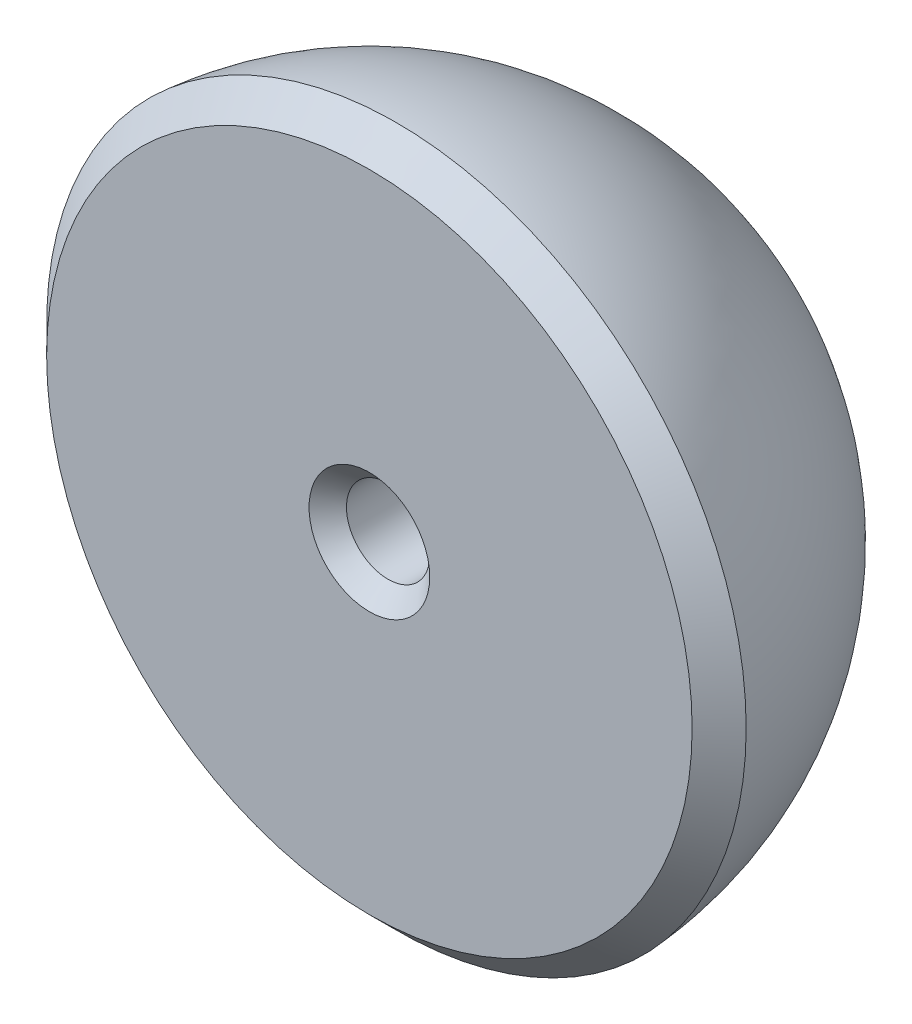
ISO-10303-21;
HEADER;
FILE_DESCRIPTION(('STEP AP214'),'2;1');
FILE_NAME('part.step','',(''),(''),'','','');
FILE_SCHEMA(('AUTOMOTIVE_DESIGN { 1 0 10303 214 1 1 1 1 }'));
ENDSEC;
DATA;
#1=APPLICATION_CONTEXT('core data for automotive mechanical design processes');
#2=APPLICATION_PROTOCOL_DEFINITION('international standard','automotive_design',2000,#1);
#3=PRODUCT_CONTEXT('',#1,'mechanical');
#4=PRODUCT('Part','Part','',(#3));
#5=PRODUCT_RELATED_PRODUCT_CATEGORY('part','',(#4));
#6=PRODUCT_DEFINITION_FORMATION('','',#4);
#7=PRODUCT_DEFINITION_CONTEXT('part definition',#1,'design');
#8=PRODUCT_DEFINITION('design','',#6,#7);
#9=PRODUCT_DEFINITION_SHAPE('','',#8);
#10=(LENGTH_UNIT() NAMED_UNIT(*) SI_UNIT(.MILLI.,.METRE.));
#11=(NAMED_UNIT(*) PLANE_ANGLE_UNIT() SI_UNIT($,.RADIAN.));
#12=(NAMED_UNIT(*) SI_UNIT($,.STERADIAN.) SOLID_ANGLE_UNIT());
#13=UNCERTAINTY_MEASURE_WITH_UNIT(LENGTH_MEASURE(1.E-05),#10,'distance_accuracy_value','');
#14=(GEOMETRIC_REPRESENTATION_CONTEXT(3) GLOBAL_UNCERTAINTY_ASSIGNED_CONTEXT((#13)) GLOBAL_UNIT_ASSIGNED_CONTEXT((#10,
#11,#12)) REPRESENTATION_CONTEXT('',''));
#15=CARTESIAN_POINT('',(0.,0.,0.));
#16=DIRECTION('',(0.,0.,1.));
#17=DIRECTION('',(1.,0.,0.));
#18=AXIS2_PLACEMENT_3D('',#15,#16,#17);
#19=CARTESIAN_POINT('',(9.525,0.,0.));
#20=DIRECTION('',(0.,0.,1.));
#21=DIRECTION('',(1.,0.,0.));
#22=AXIS2_PLACEMENT_3D('',#19,#20,#21);
#23=PLANE('',#22);
#24=CARTESIAN_POINT('',(0.,0.,0.));
#25=DIRECTION('',(0.,0.,1.));
#26=DIRECTION('',(1.,0.,0.));
#27=AXIS2_PLACEMENT_3D('',#24,#25,#26);
#28=CIRCLE('',#27,1.63829999999998);
#29=CARTESIAN_POINT('',(1.63829999999998,0.,0.));
#30=VERTEX_POINT('',#29);
#31=EDGE_CURVE('E11',#30,#30,#28,.F.);
#32=ORIENTED_EDGE('',*,*,#31,.T.);
#33=EDGE_LOOP('',(#32));
#34=FACE_BOUND('',#33,.T.);
#35=CARTESIAN_POINT('',(0.,0.,0.));
#36=DIRECTION('',(0.,0.,1.));
#37=DIRECTION('',(1.,0.,0.));
#38=AXIS2_PLACEMENT_3D('',#35,#36,#37);
#39=CIRCLE('',#38,8.763);
#40=CARTESIAN_POINT('',(8.763,0.,0.));
#41=VERTEX_POINT('',#40);
#42=EDGE_CURVE('E84',#41,#41,#39,.T.);
#43=ORIENTED_EDGE('',*,*,#42,.T.);
#44=EDGE_LOOP('',(#43));
#45=FACE_BOUND('',#44,.T.);
#46=ADVANCED_FACE('F36',(#34,#45),#23,.T.);
#47=CARTESIAN_POINT('',(0.,0.,0.));
#48=DIRECTION('',(0.,0.,1.));
#49=DIRECTION('',(1.,0.,0.));
#50=AXIS2_PLACEMENT_3D('',#47,#48,#49);
#51=SPHERICAL_SURFACE('',#50,9.525);
#52=CARTESIAN_POINT('',(0.,0.,-0.733699922779171));
#53=DIRECTION('',(0.,0.,1.));
#54=DIRECTION('',(1.,0.,0.));
#55=AXIS2_PLACEMENT_3D('',#52,#53,#54);
#56=CIRCLE('',#55,9.49669992277917);
#57=CARTESIAN_POINT('',(9.49669992277917,0.,-0.733699922779171));
#58=VERTEX_POINT('',#57);
#59=EDGE_CURVE('E81',#58,#58,#56,.F.);
#60=ORIENTED_EDGE('',*,*,#59,.T.);
#61=EDGE_LOOP('',(#60));
#62=FACE_BOUND('',#61,.T.);
#63=ADVANCED_FACE('F49',(#62),#51,.T.);
#64=CARTESIAN_POINT('',(0.,0.,-6.35));
#65=DIRECTION('',(0.,0.,1.));
#66=DIRECTION('',(1.,0.,0.));
#67=AXIS2_PLACEMENT_3D('',#64,#65,#66);
#68=CONICAL_SURFACE('',#67,1.1303,1.02974425867665);
#69=CARTESIAN_POINT('',(0.,0.,-6.58129440224576));
#70=DIRECTION('',(0.,0.,1.));
#71=DIRECTION('',(1.,0.,0.));
#72=AXIS2_PLACEMENT_3D('',#69,#70,#71);
#73=CIRCLE('',#72,0.74536147195985);
#74=CARTESIAN_POINT('',(0.74536147195985,0.,-6.58129440224576));
#75=VERTEX_POINT('',#74);
#76=EDGE_CURVE('E89',#75,#75,#73,.T.);
#77=ORIENTED_EDGE('',*,*,#76,.T.);
#78=EDGE_LOOP('',(#77));
#79=FACE_BOUND('',#78,.T.);
#80=CARTESIAN_POINT('',(0.,0.,-7.02915275768685));
#81=VERTEX_POINT('',#80);
#82=VERTEX_LOOP('',#81);
#83=FACE_BOUND('',#82,.T.);
#84=ADVANCED_FACE('F46',(#79,#83),#68,.F.);
#85=CARTESIAN_POINT('',(0.,0.,0.));
#86=DIRECTION('',(0.,0.,1.));
#87=DIRECTION('',(1.,0.,0.));
#88=AXIS2_PLACEMENT_3D('',#85,#86,#87);
#89=CYLINDRICAL_SURFACE('',#88,1.13029999999999);
#90=CARTESIAN_POINT('',(0.,0.,-0.507999999999989));
#91=DIRECTION('',(0.,0.,1.));
#92=DIRECTION('',(1.,0.,0.));
#93=AXIS2_PLACEMENT_3D('',#90,#91,#92);
#94=CIRCLE('',#93,1.13029999999999);
#95=CARTESIAN_POINT('',(1.13029999999999,0.,-0.507999999999989));
#96=VERTEX_POINT('',#95);
#97=EDGE_CURVE('E43',#96,#96,#94,.T.);
#98=ORIENTED_EDGE('',*,*,#97,.T.);
#99=EDGE_LOOP('',(#98));
#100=FACE_BOUND('',#99,.T.);
#101=CARTESIAN_POINT('',(0.,0.,-5.90091785731346));
#102=DIRECTION('',(0.,0.,1.));
#103=DIRECTION('',(1.,0.,0.));
#104=AXIS2_PLACEMENT_3D('',#101,#102,#103);
#105=CIRCLE('',#104,1.13029999999999);
#106=CARTESIAN_POINT('',(1.13029999999999,0.,-5.90091785731346));
#107=VERTEX_POINT('',#106);
#108=EDGE_CURVE('E85',#107,#107,#105,.F.);
#109=ORIENTED_EDGE('',*,*,#108,.T.);
#110=EDGE_LOOP('',(#109));
#111=FACE_BOUND('',#110,.T.);
#112=ADVANCED_FACE('F48',(#100,#111),#89,.F.);
#113=CARTESIAN_POINT('',(0.,0.,-5.90091785731346));
#114=DIRECTION('',(0.,0.,1.));
#115=DIRECTION('',(1.,0.,0.));
#116=AXIS2_PLACEMENT_3D('',#113,#114,#115);
#117=DEGENERATE_TOROIDAL_SURFACE('',#116,0.336549999999993,0.79375,.T.);
#118=ORIENTED_EDGE('',*,*,#108,.F.);
#119=EDGE_LOOP('',(#118));
#120=FACE_BOUND('',#119,.T.);
#121=ORIENTED_EDGE('',*,*,#76,.F.);
#122=EDGE_LOOP('',(#121));
#123=FACE_BOUND('',#122,.T.);
#124=ADVANCED_FACE('F56',(#120,#123),#117,.F.);
#125=CARTESIAN_POINT('',(0.,0.,0.));
#126=DIRECTION('',(0.,0.,-1.));
#127=DIRECTION('',(-1.,0.,0.));
#128=AXIS2_PLACEMENT_3D('',#125,#126,#127);
#129=CONICAL_SURFACE('',#128,8.763,0.785398163397447);
#130=ORIENTED_EDGE('',*,*,#59,.F.);
#131=EDGE_LOOP('',(#130));
#132=FACE_BOUND('',#131,.T.);
#133=ORIENTED_EDGE('',*,*,#42,.F.);
#134=EDGE_LOOP('',(#133));
#135=FACE_BOUND('',#134,.T.);
#136=ADVANCED_FACE('F70',(#132,#135),#129,.T.);
#137=CARTESIAN_POINT('',(0.,0.,-0.507999999999989));
#138=DIRECTION('',(0.,0.,1.));
#139=DIRECTION('',(1.,0.,0.));
#140=AXIS2_PLACEMENT_3D('',#137,#138,#139);
#141=CONICAL_SURFACE('',#140,1.13029999999999,0.785398163397451);
#142=ORIENTED_EDGE('',*,*,#31,.F.);
#143=EDGE_LOOP('',(#142));
#144=FACE_BOUND('',#143,.T.);
#145=ORIENTED_EDGE('',*,*,#97,.F.);
#146=EDGE_LOOP('',(#145));
#147=FACE_BOUND('',#146,.T.);
#148=ADVANCED_FACE('F38',(#144,#147),#141,.F.);
#149=CLOSED_SHELL('',(#46,#63,#84,#112,#124,#136,#148));
#150=MANIFOLD_SOLID_BREP('B2',#149);
#151=ADVANCED_BREP_SHAPE_REPRESENTATION('',(#18,#150),#14);
#152=SHAPE_DEFINITION_REPRESENTATION(#9,#151);
ENDSEC;
END-ISO-10303-21;
